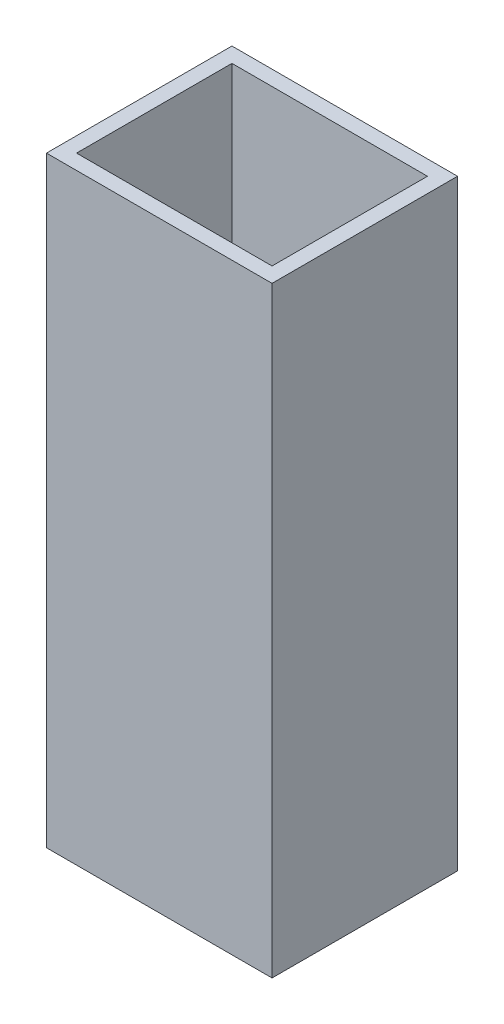
ISO-10303-21;
HEADER;
FILE_DESCRIPTION(('STEP AP214'),'2;1');
FILE_NAME('part.step','',(''),(''),'','','');
FILE_SCHEMA(('AUTOMOTIVE_DESIGN { 1 0 10303 214 1 1 1 1 }'));
ENDSEC;
DATA;
#1=APPLICATION_CONTEXT('core data for automotive mechanical design processes');
#2=APPLICATION_PROTOCOL_DEFINITION('international standard','automotive_design',2000,#1);
#3=PRODUCT_CONTEXT('',#1,'mechanical');
#4=PRODUCT('Part','Part','',(#3));
#5=PRODUCT_RELATED_PRODUCT_CATEGORY('part','',(#4));
#6=PRODUCT_DEFINITION_FORMATION('','',#4);
#7=PRODUCT_DEFINITION_CONTEXT('part definition',#1,'design');
#8=PRODUCT_DEFINITION('design','',#6,#7);
#9=PRODUCT_DEFINITION_SHAPE('','',#8);
#10=(LENGTH_UNIT() NAMED_UNIT(*) SI_UNIT(.MILLI.,.METRE.));
#11=(NAMED_UNIT(*) PLANE_ANGLE_UNIT() SI_UNIT($,.RADIAN.));
#12=(NAMED_UNIT(*) SI_UNIT($,.STERADIAN.) SOLID_ANGLE_UNIT());
#13=UNCERTAINTY_MEASURE_WITH_UNIT(LENGTH_MEASURE(1.E-05),#10,'distance_accuracy_value','');
#14=(GEOMETRIC_REPRESENTATION_CONTEXT(3) GLOBAL_UNCERTAINTY_ASSIGNED_CONTEXT((#13)) GLOBAL_UNIT_ASSIGNED_CONTEXT((#10,
#11,#12)) REPRESENTATION_CONTEXT('',''));
#15=CARTESIAN_POINT('',(0.,0.,0.));
#16=DIRECTION('',(0.,0.,1.));
#17=DIRECTION('',(1.,0.,0.));
#18=AXIS2_PLACEMENT_3D('',#15,#16,#17);
#19=CARTESIAN_POINT('',(0.,3.,0.));
#20=DIRECTION('',(1.,0.,0.));
#21=DIRECTION('',(0.,0.,-1.));
#22=AXIS2_PLACEMENT_3D('',#19,#20,#21);
#23=PLANE('',#22);
#24=DIRECTION('',(0.,0.,1.));
#25=VECTOR('',#24,1.);
#26=CARTESIAN_POINT('',(0.,0.,0.));
#27=LINE('',#26,#25);
#28=CARTESIAN_POINT('',(0.,0.,-37.));
#29=VERTEX_POINT('',#28);
#30=CARTESIAN_POINT('',(0.,0.,0.));
#31=VERTEX_POINT('',#30);
#32=EDGE_CURVE('E153',#29,#31,#27,.T.);
#33=ORIENTED_EDGE('',*,*,#32,.T.);
#34=DIRECTION('',(0.,-1.,0.));
#35=VECTOR('',#34,1.);
#36=CARTESIAN_POINT('',(0.,3.,0.));
#37=LINE('',#36,#35);
#38=CARTESIAN_POINT('',(0.,120.,0.));
#39=VERTEX_POINT('',#38);
#40=EDGE_CURVE('E11',#39,#31,#37,.T.);
#41=ORIENTED_EDGE('',*,*,#40,.F.);
#42=DIRECTION('',(0.,0.,1.));
#43=VECTOR('',#42,1.);
#44=CARTESIAN_POINT('',(0.,120.,-37.));
#45=LINE('',#44,#43);
#46=CARTESIAN_POINT('',(0.,120.,-37.));
#47=VERTEX_POINT('',#46);
#48=EDGE_CURVE('E118',#47,#39,#45,.T.);
#49=ORIENTED_EDGE('',*,*,#48,.F.);
#50=DIRECTION('',(0.,-1.,0.));
#51=VECTOR('',#50,1.);
#52=CARTESIAN_POINT('',(0.,3.,-37.));
#53=LINE('',#52,#51);
#54=EDGE_CURVE('E161',#47,#29,#53,.T.);
#55=ORIENTED_EDGE('',*,*,#54,.T.);
#56=EDGE_LOOP('',(#33,#41,#49,#55));
#57=FACE_BOUND('',#56,.T.);
#58=ADVANCED_FACE('F36',(#57),#23,.F.);
#59=CARTESIAN_POINT('',(0.,3.,0.));
#60=DIRECTION('',(0.,0.,-1.));
#61=DIRECTION('',(-1.,0.,0.));
#62=AXIS2_PLACEMENT_3D('',#59,#60,#61);
#63=PLANE('',#62);
#64=DIRECTION('',(1.,0.,0.));
#65=VECTOR('',#64,1.);
#66=CARTESIAN_POINT('',(0.,0.,0.));
#67=LINE('',#66,#65);
#68=CARTESIAN_POINT('',(45.,0.,0.));
#69=VERTEX_POINT('',#68);
#70=EDGE_CURVE('E156',#31,#69,#67,.T.);
#71=ORIENTED_EDGE('',*,*,#70,.T.);
#72=DIRECTION('',(0.,-1.,0.));
#73=VECTOR('',#72,1.);
#74=CARTESIAN_POINT('',(45.,3.,0.));
#75=LINE('',#74,#73);
#76=CARTESIAN_POINT('',(45.,120.,0.));
#77=VERTEX_POINT('',#76);
#78=EDGE_CURVE('E43',#77,#69,#75,.T.);
#79=ORIENTED_EDGE('',*,*,#78,.F.);
#80=DIRECTION('',(1.,0.,0.));
#81=VECTOR('',#80,1.);
#82=CARTESIAN_POINT('',(0.,120.,0.));
#83=LINE('',#82,#81);
#84=EDGE_CURVE('E144',#39,#77,#83,.T.);
#85=ORIENTED_EDGE('',*,*,#84,.F.);
#86=ORIENTED_EDGE('',*,*,#40,.T.);
#87=EDGE_LOOP('',(#71,#79,#85,#86));
#88=FACE_BOUND('',#87,.T.);
#89=ADVANCED_FACE('F179',(#88),#63,.F.);
#90=CARTESIAN_POINT('',(45.,3.,0.));
#91=DIRECTION('',(-1.,0.,0.));
#92=DIRECTION('',(0.,0.,1.));
#93=AXIS2_PLACEMENT_3D('',#90,#91,#92);
#94=PLANE('',#93);
#95=DIRECTION('',(0.,0.,-1.));
#96=VECTOR('',#95,1.);
#97=CARTESIAN_POINT('',(45.,0.,0.));
#98=LINE('',#97,#96);
#99=CARTESIAN_POINT('',(45.,0.,-37.));
#100=VERTEX_POINT('',#99);
#101=EDGE_CURVE('E158',#69,#100,#98,.T.);
#102=ORIENTED_EDGE('',*,*,#101,.T.);
#103=DIRECTION('',(0.,-1.,0.));
#104=VECTOR('',#103,1.);
#105=CARTESIAN_POINT('',(45.,3.,-37.));
#106=LINE('',#105,#104);
#107=CARTESIAN_POINT('',(45.,120.,-37.));
#108=VERTEX_POINT('',#107);
#109=EDGE_CURVE('E163',#108,#100,#106,.T.);
#110=ORIENTED_EDGE('',*,*,#109,.F.);
#111=DIRECTION('',(0.,0.,-1.));
#112=VECTOR('',#111,1.);
#113=CARTESIAN_POINT('',(45.,120.,-37.));
#114=LINE('',#113,#112);
#115=EDGE_CURVE('E147',#77,#108,#114,.T.);
#116=ORIENTED_EDGE('',*,*,#115,.F.);
#117=ORIENTED_EDGE('',*,*,#78,.T.);
#118=EDGE_LOOP('',(#102,#110,#116,#117));
#119=FACE_BOUND('',#118,.T.);
#120=ADVANCED_FACE('F168',(#119),#94,.F.);
#121=CARTESIAN_POINT('',(0.,3.,-37.));
#122=DIRECTION('',(0.,0.,1.));
#123=DIRECTION('',(1.,0.,0.));
#124=AXIS2_PLACEMENT_3D('',#121,#122,#123);
#125=PLANE('',#124);
#126=DIRECTION('',(-1.,0.,0.));
#127=VECTOR('',#126,1.);
#128=CARTESIAN_POINT('',(0.,0.,-37.));
#129=LINE('',#128,#127);
#130=EDGE_CURVE('E58',#100,#29,#129,.T.);
#131=ORIENTED_EDGE('',*,*,#130,.T.);
#132=ORIENTED_EDGE('',*,*,#54,.F.);
#133=DIRECTION('',(-1.,0.,0.));
#134=VECTOR('',#133,1.);
#135=CARTESIAN_POINT('',(0.,120.,-37.));
#136=LINE('',#135,#134);
#137=EDGE_CURVE('E150',#108,#47,#136,.T.);
#138=ORIENTED_EDGE('',*,*,#137,.F.);
#139=ORIENTED_EDGE('',*,*,#109,.T.);
#140=EDGE_LOOP('',(#131,#132,#138,#139));
#141=FACE_BOUND('',#140,.T.);
#142=ADVANCED_FACE('F177',(#141),#125,.F.);
#143=CARTESIAN_POINT('',(0.,0.,0.));
#144=DIRECTION('',(0.,-1.,0.));
#145=DIRECTION('',(0.,0.,-1.));
#146=AXIS2_PLACEMENT_3D('',#143,#144,#145);
#147=PLANE('',#146);
#148=ORIENTED_EDGE('',*,*,#32,.F.);
#149=ORIENTED_EDGE('',*,*,#130,.F.);
#150=ORIENTED_EDGE('',*,*,#101,.F.);
#151=ORIENTED_EDGE('',*,*,#70,.F.);
#152=EDGE_LOOP('',(#148,#149,#150,#151));
#153=FACE_BOUND('',#152,.T.);
#154=ADVANCED_FACE('F173',(#153),#147,.T.);
#155=CARTESIAN_POINT('',(0.,120.,0.));
#156=DIRECTION('',(0.,1.,0.));
#157=DIRECTION('',(0.,0.,1.));
#158=AXIS2_PLACEMENT_3D('',#155,#156,#157);
#159=PLANE('',#158);
#160=ORIENTED_EDGE('',*,*,#48,.T.);
#161=ORIENTED_EDGE('',*,*,#84,.T.);
#162=ORIENTED_EDGE('',*,*,#115,.T.);
#163=ORIENTED_EDGE('',*,*,#137,.T.);
#164=EDGE_LOOP('',(#160,#161,#162,#163));
#165=FACE_BOUND('',#164,.T.);
#166=DIRECTION('',(1.,0.,0.));
#167=VECTOR('',#166,1.);
#168=CARTESIAN_POINT('',(3.,120.,-3.));
#169=LINE('',#168,#167);
#170=CARTESIAN_POINT('',(3.,120.,-3.));
#171=VERTEX_POINT('',#170);
#172=CARTESIAN_POINT('',(42.,120.,-3.));
#173=VERTEX_POINT('',#172);
#174=EDGE_CURVE('E110',#171,#173,#169,.T.);
#175=ORIENTED_EDGE('',*,*,#174,.F.);
#176=DIRECTION('',(0.,0.,1.));
#177=VECTOR('',#176,1.);
#178=CARTESIAN_POINT('',(3.,120.,-34.));
#179=LINE('',#178,#177);
#180=CARTESIAN_POINT('',(3.,120.,-34.));
#181=VERTEX_POINT('',#180);
#182=EDGE_CURVE('E102',#181,#171,#179,.T.);
#183=ORIENTED_EDGE('',*,*,#182,.F.);
#184=DIRECTION('',(-1.,0.,0.));
#185=VECTOR('',#184,1.);
#186=CARTESIAN_POINT('',(3.,120.,-34.));
#187=LINE('',#186,#185);
#188=CARTESIAN_POINT('',(42.,120.,-34.));
#189=VERTEX_POINT('',#188);
#190=EDGE_CURVE('E126',#189,#181,#187,.T.);
#191=ORIENTED_EDGE('',*,*,#190,.F.);
#192=DIRECTION('',(0.,0.,-1.));
#193=VECTOR('',#192,1.);
#194=CARTESIAN_POINT('',(42.,120.,-34.));
#195=LINE('',#194,#193);
#196=EDGE_CURVE('E124',#173,#189,#195,.T.);
#197=ORIENTED_EDGE('',*,*,#196,.F.);
#198=EDGE_LOOP('',(#175,#183,#191,#197));
#199=FACE_BOUND('',#198,.T.);
#200=ADVANCED_FACE('F122',(#165,#199),#159,.T.);
#201=CARTESIAN_POINT('',(3.,120.,-34.));
#202=DIRECTION('',(1.,0.,0.));
#203=DIRECTION('',(0.,0.,-1.));
#204=AXIS2_PLACEMENT_3D('',#201,#202,#203);
#205=PLANE('',#204);
#206=DIRECTION('',(0.,0.,1.));
#207=VECTOR('',#206,1.);
#208=CARTESIAN_POINT('',(3.,3.,-34.));
#209=LINE('',#208,#207);
#210=CARTESIAN_POINT('',(3.,3.,-34.));
#211=VERTEX_POINT('',#210);
#212=CARTESIAN_POINT('',(3.,3.,-3.));
#213=VERTEX_POINT('',#212);
#214=EDGE_CURVE('E130',#211,#213,#209,.T.);
#215=ORIENTED_EDGE('',*,*,#214,.F.);
#216=DIRECTION('',(0.,-1.,0.));
#217=VECTOR('',#216,1.);
#218=CARTESIAN_POINT('',(3.,120.,-34.));
#219=LINE('',#218,#217);
#220=EDGE_CURVE('E50',#181,#211,#219,.T.);
#221=ORIENTED_EDGE('',*,*,#220,.F.);
#222=ORIENTED_EDGE('',*,*,#182,.T.);
#223=DIRECTION('',(0.,-1.,0.));
#224=VECTOR('',#223,1.);
#225=CARTESIAN_POINT('',(3.,120.,-3.));
#226=LINE('',#225,#224);
#227=EDGE_CURVE('E105',#171,#213,#226,.T.);
#228=ORIENTED_EDGE('',*,*,#227,.T.);
#229=EDGE_LOOP('',(#215,#221,#222,#228));
#230=FACE_BOUND('',#229,.T.);
#231=ADVANCED_FACE('F104',(#230),#205,.T.);
#232=CARTESIAN_POINT('',(3.,120.,-3.));
#233=DIRECTION('',(0.,0.,-1.));
#234=DIRECTION('',(-1.,0.,0.));
#235=AXIS2_PLACEMENT_3D('',#232,#233,#234);
#236=PLANE('',#235);
#237=DIRECTION('',(1.,0.,0.));
#238=VECTOR('',#237,1.);
#239=CARTESIAN_POINT('',(3.,3.,-3.));
#240=LINE('',#239,#238);
#241=CARTESIAN_POINT('',(42.,3.,-3.));
#242=VERTEX_POINT('',#241);
#243=EDGE_CURVE('E117',#213,#242,#240,.T.);
#244=ORIENTED_EDGE('',*,*,#243,.F.);
#245=ORIENTED_EDGE('',*,*,#227,.F.);
#246=ORIENTED_EDGE('',*,*,#174,.T.);
#247=DIRECTION('',(0.,-1.,0.));
#248=VECTOR('',#247,1.);
#249=CARTESIAN_POINT('',(42.,120.,-3.));
#250=LINE('',#249,#248);
#251=EDGE_CURVE('E119',#173,#242,#250,.T.);
#252=ORIENTED_EDGE('',*,*,#251,.T.);
#253=EDGE_LOOP('',(#244,#245,#246,#252));
#254=FACE_BOUND('',#253,.T.);
#255=ADVANCED_FACE('F114',(#254),#236,.T.);
#256=CARTESIAN_POINT('',(42.,120.,-34.));
#257=DIRECTION('',(-1.,0.,0.));
#258=DIRECTION('',(0.,0.,1.));
#259=AXIS2_PLACEMENT_3D('',#256,#257,#258);
#260=PLANE('',#259);
#261=DIRECTION('',(0.,0.,-1.));
#262=VECTOR('',#261,1.);
#263=CARTESIAN_POINT('',(42.,3.,-34.));
#264=LINE('',#263,#262);
#265=CARTESIAN_POINT('',(42.,3.,-34.));
#266=VERTEX_POINT('',#265);
#267=EDGE_CURVE('E133',#242,#266,#264,.T.);
#268=ORIENTED_EDGE('',*,*,#267,.F.);
#269=ORIENTED_EDGE('',*,*,#251,.F.);
#270=ORIENTED_EDGE('',*,*,#196,.T.);
#271=DIRECTION('',(0.,-1.,0.));
#272=VECTOR('',#271,1.);
#273=CARTESIAN_POINT('',(42.,120.,-34.));
#274=LINE('',#273,#272);
#275=EDGE_CURVE('E139',#189,#266,#274,.T.);
#276=ORIENTED_EDGE('',*,*,#275,.T.);
#277=EDGE_LOOP('',(#268,#269,#270,#276));
#278=FACE_BOUND('',#277,.T.);
#279=ADVANCED_FACE('F202',(#278),#260,.T.);
#280=CARTESIAN_POINT('',(3.,120.,-34.));
#281=DIRECTION('',(0.,0.,1.));
#282=DIRECTION('',(1.,0.,0.));
#283=AXIS2_PLACEMENT_3D('',#280,#281,#282);
#284=PLANE('',#283);
#285=DIRECTION('',(-1.,0.,0.));
#286=VECTOR('',#285,1.);
#287=CARTESIAN_POINT('',(3.,3.,-34.));
#288=LINE('',#287,#286);
#289=EDGE_CURVE('E111',#266,#211,#288,.T.);
#290=ORIENTED_EDGE('',*,*,#289,.F.);
#291=ORIENTED_EDGE('',*,*,#275,.F.);
#292=ORIENTED_EDGE('',*,*,#190,.T.);
#293=ORIENTED_EDGE('',*,*,#220,.T.);
#294=EDGE_LOOP('',(#290,#291,#292,#293));
#295=FACE_BOUND('',#294,.T.);
#296=ADVANCED_FACE('F194',(#295),#284,.T.);
#297=CARTESIAN_POINT('',(0.,3.,0.));
#298=DIRECTION('',(0.,-1.,0.));
#299=DIRECTION('',(0.,0.,-1.));
#300=AXIS2_PLACEMENT_3D('',#297,#298,#299);
#301=PLANE('',#300);
#302=ORIENTED_EDGE('',*,*,#289,.T.);
#303=ORIENTED_EDGE('',*,*,#214,.T.);
#304=ORIENTED_EDGE('',*,*,#243,.T.);
#305=ORIENTED_EDGE('',*,*,#267,.T.);
#306=EDGE_LOOP('',(#302,#303,#304,#305));
#307=FACE_BOUND('',#306,.T.);
#308=ADVANCED_FACE('F191',(#307),#301,.F.);
#309=CLOSED_SHELL('',(#58,#89,#120,#142,#154,#200,#231,#255,#279,#296,#308));
#310=MANIFOLD_SOLID_BREP('B2',#309);
#311=ADVANCED_BREP_SHAPE_REPRESENTATION('',(#18,#310),#14);
#312=SHAPE_DEFINITION_REPRESENTATION(#9,#311);
ENDSEC;
END-ISO-10303-21;
